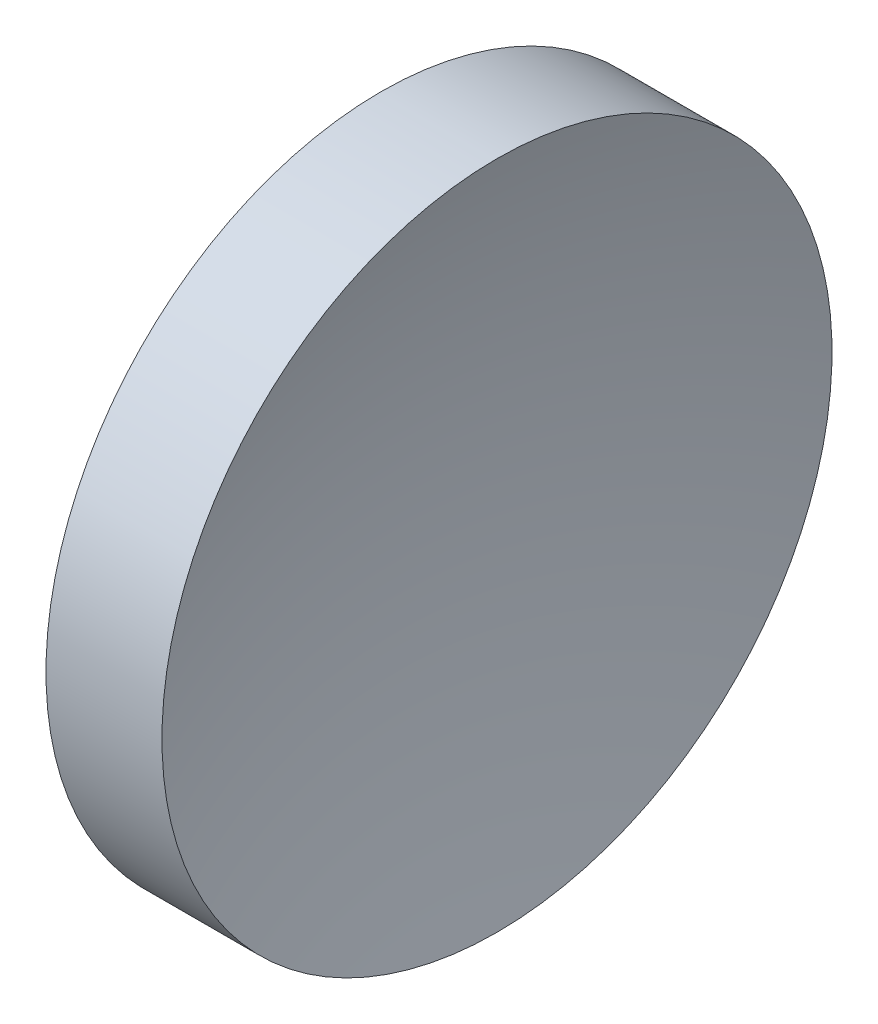
ISO-10303-21;
HEADER;
FILE_DESCRIPTION(('STEP AP214'),'2;1');
FILE_NAME('part.step','',(''),(''),'','','');
FILE_SCHEMA(('AUTOMOTIVE_DESIGN { 1 0 10303 214 1 1 1 1 }'));
ENDSEC;
DATA;
#1=APPLICATION_CONTEXT('core data for automotive mechanical design processes');
#2=APPLICATION_PROTOCOL_DEFINITION('international standard','automotive_design',2000,#1);
#3=PRODUCT_CONTEXT('',#1,'mechanical');
#4=PRODUCT('Part','Part','',(#3));
#5=PRODUCT_RELATED_PRODUCT_CATEGORY('part','',(#4));
#6=PRODUCT_DEFINITION_FORMATION('','',#4);
#7=PRODUCT_DEFINITION_CONTEXT('part definition',#1,'design');
#8=PRODUCT_DEFINITION('design','',#6,#7);
#9=PRODUCT_DEFINITION_SHAPE('','',#8);
#10=(LENGTH_UNIT() NAMED_UNIT(*) SI_UNIT(.MILLI.,.METRE.));
#11=(NAMED_UNIT(*) PLANE_ANGLE_UNIT() SI_UNIT($,.RADIAN.));
#12=(NAMED_UNIT(*) SI_UNIT($,.STERADIAN.) SOLID_ANGLE_UNIT());
#13=UNCERTAINTY_MEASURE_WITH_UNIT(LENGTH_MEASURE(1.E-05),#10,'distance_accuracy_value','');
#14=(GEOMETRIC_REPRESENTATION_CONTEXT(3) GLOBAL_UNCERTAINTY_ASSIGNED_CONTEXT((#13)) GLOBAL_UNIT_ASSIGNED_CONTEXT((#10,
#11,#12)) REPRESENTATION_CONTEXT('',''));
#15=CARTESIAN_POINT('',(0.,0.,0.));
#16=DIRECTION('',(0.,0.,1.));
#17=DIRECTION('',(1.,0.,0.));
#18=AXIS2_PLACEMENT_3D('',#15,#16,#17);
#19=CARTESIAN_POINT('',(72.1944226262245,26.0622521828061,0.));
#20=DIRECTION('',(-1.,0.,0.));
#21=DIRECTION('',(0.,-1.,0.));
#22=AXIS2_PLACEMENT_3D('',#19,#20,#21);
#23=SPHERICAL_SURFACE('',#22,25.84);
#24=CARTESIAN_POINT('',(47.6240013844142,26.0622521828061,0.));
#25=DIRECTION('',(-1.,0.,0.));
#26=DIRECTION('',(0.,-1.,0.));
#27=AXIS2_PLACEMENT_3D('',#24,#25,#26);
#28=CIRCLE('',#27,8.);
#29=CARTESIAN_POINT('',(47.6240013844142,18.0622521828061,0.));
#30=VERTEX_POINT('',#29);
#31=EDGE_CURVE('E10',#30,#30,#28,.T.);
#32=ORIENTED_EDGE('',*,*,#31,.F.);
#33=EDGE_LOOP('',(#32));
#34=FACE_BOUND('',#33,.T.);
#35=ADVANCED_FACE('F35',(#34),#23,.F.);
#36=CARTESIAN_POINT('',(43.0119502361649,26.0622521828061,0.));
#37=DIRECTION('',(-1.,0.,0.));
#38=DIRECTION('',(0.,-1.,0.));
#39=AXIS2_PLACEMENT_3D('',#36,#37,#38);
#40=CYLINDRICAL_SURFACE('',#39,8.);
#41=CARTESIAN_POINT('',(44.8544226262245,26.0622521828061,0.));
#42=DIRECTION('',(-1.,0.,0.));
#43=DIRECTION('',(0.,-1.,0.));
#44=AXIS2_PLACEMENT_3D('',#41,#42,#43);
#45=CIRCLE('',#44,8.);
#46=CARTESIAN_POINT('',(44.8544226262245,18.0622521828061,0.));
#47=VERTEX_POINT('',#46);
#48=EDGE_CURVE('E41',#47,#47,#45,.T.);
#49=ORIENTED_EDGE('',*,*,#48,.F.);
#50=EDGE_LOOP('',(#49));
#51=FACE_BOUND('',#50,.T.);
#52=ORIENTED_EDGE('',*,*,#31,.T.);
#53=EDGE_LOOP('',(#52));
#54=FACE_BOUND('',#53,.T.);
#55=ADVANCED_FACE('F49',(#51,#54),#40,.T.);
#56=CARTESIAN_POINT('',(44.8544226262245,26.0622521828061,0.));
#57=DIRECTION('',(1.,0.,0.));
#58=DIRECTION('',(0.,1.,0.));
#59=AXIS2_PLACEMENT_3D('',#56,#57,#58);
#60=PLANE('',#59);
#61=ORIENTED_EDGE('',*,*,#48,.T.);
#62=EDGE_LOOP('',(#61));
#63=FACE_BOUND('',#62,.T.);
#64=ADVANCED_FACE('F47',(#63),#60,.F.);
#65=CLOSED_SHELL('',(#35,#55,#64));
#66=MANIFOLD_SOLID_BREP('B2',#65);
#67=ADVANCED_BREP_SHAPE_REPRESENTATION('',(#18,#66),#14);
#68=SHAPE_DEFINITION_REPRESENTATION(#9,#67);
ENDSEC;
END-ISO-10303-21;
